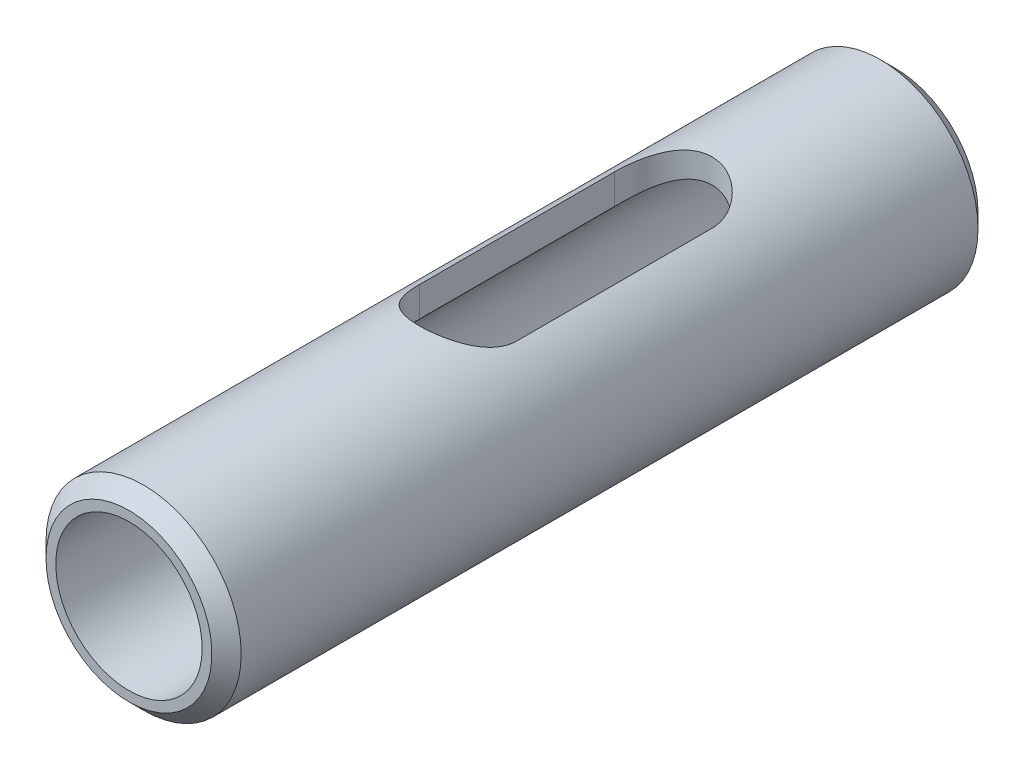
ISO-10303-21;
HEADER;
FILE_DESCRIPTION(('STEP AP214'),'2;1');
FILE_NAME('part.step','',(''),(''),'','','');
FILE_SCHEMA(('AUTOMOTIVE_DESIGN { 1 0 10303 214 1 1 1 1 }'));
ENDSEC;
DATA;
#1=APPLICATION_CONTEXT('core data for automotive mechanical design processes');
#2=APPLICATION_PROTOCOL_DEFINITION('international standard','automotive_design',2000,#1);
#3=PRODUCT_CONTEXT('',#1,'mechanical');
#4=PRODUCT('Part','Part','',(#3));
#5=PRODUCT_RELATED_PRODUCT_CATEGORY('part','',(#4));
#6=PRODUCT_DEFINITION_FORMATION('','',#4);
#7=PRODUCT_DEFINITION_CONTEXT('part definition',#1,'design');
#8=PRODUCT_DEFINITION('design','',#6,#7);
#9=PRODUCT_DEFINITION_SHAPE('','',#8);
#10=(LENGTH_UNIT() NAMED_UNIT(*) SI_UNIT(.MILLI.,.METRE.));
#11=(NAMED_UNIT(*) PLANE_ANGLE_UNIT() SI_UNIT($,.RADIAN.));
#12=(NAMED_UNIT(*) SI_UNIT($,.STERADIAN.) SOLID_ANGLE_UNIT());
#13=UNCERTAINTY_MEASURE_WITH_UNIT(LENGTH_MEASURE(1.E-05),#10,'distance_accuracy_value','');
#14=(GEOMETRIC_REPRESENTATION_CONTEXT(3) GLOBAL_UNCERTAINTY_ASSIGNED_CONTEXT((#13)) GLOBAL_UNIT_ASSIGNED_CONTEXT((#10,
#11,#12)) REPRESENTATION_CONTEXT('',''));
#15=CARTESIAN_POINT('',(0.,0.,0.));
#16=DIRECTION('',(0.,0.,1.));
#17=DIRECTION('',(1.,0.,0.));
#18=AXIS2_PLACEMENT_3D('',#15,#16,#17);
#19=CARTESIAN_POINT('',(0.,0.,0.));
#20=DIRECTION('',(0.,0.,1.));
#21=DIRECTION('',(1.,0.,0.));
#22=AXIS2_PLACEMENT_3D('',#19,#20,#21);
#23=CYLINDRICAL_SURFACE('',#22,15.);
#24=DIRECTION('',(0.,0.,1.));
#25=VECTOR('',#24,1.);
#26=CARTESIAN_POINT('',(-9.99999999999997,11.180339887499,0.));
#27=LINE('',#26,#25);
#28=CARTESIAN_POINT('',(-9.99999999999997,11.180339887499,-376.5));
#29=VERTEX_POINT('',#28);
#30=CARTESIAN_POINT('',(-10.,11.1803398874989,-416.5));
#31=VERTEX_POINT('',#30);
#32=EDGE_CURVE('E91',#29,#31,#27,.F.);
#33=ORIENTED_EDGE('',*,*,#32,.F.);
#34=CARTESIAN_POINT('',(10.,11.1803398874989,-376.5));
#35=CARTESIAN_POINT('',(10.0000019662644,11.1803341285553,-376.377091916708));
#36=CARTESIAN_POINT('',(9.99773339672962,11.182367652214,-376.254204561337));
#37=CARTESIAN_POINT('',(9.98868075195432,11.1904562528802,-376.008740842228));
#38=CARTESIAN_POINT('',(9.98189712810507,11.196510927874,-375.88616444863));
#39=CARTESIAN_POINT('',(9.95484008556213,11.2205962021832,-375.5196585295));
#40=CARTESIAN_POINT('',(9.92786031801124,11.2445484143372,-375.276559245633));
#41=CARTESIAN_POINT('',(9.85692199140147,11.3067794801167,-374.797283930893));
#42=CARTESIAN_POINT('',(9.81313360307207,11.3449146287484,-374.56106325413));
#43=CARTESIAN_POINT('',(9.70933595979469,11.4338733583765,-374.094609159852));
#44=CARTESIAN_POINT('',(9.64932198669644,11.4847006297179,-373.864377505231));
#45=CARTESIAN_POINT('',(9.51430209888207,11.5967965567622,-373.412379236925));
#46=CARTESIAN_POINT('',(9.43937638209315,11.6580091094161,-373.190574591012));
#47=CARTESIAN_POINT('',(9.2752123820489,11.7890411827064,-372.755053191234));
#48=CARTESIAN_POINT('',(9.18597482688439,11.8588602654582,-372.541336026614));
#49=CARTESIAN_POINT('',(8.89735329466268,12.0787194524851,-371.911924424127));
#50=CARTESIAN_POINT('',(8.6773562973776,12.2389043780612,-371.50894455495));
#51=CARTESIAN_POINT('',(8.29129524792108,12.5013515100962,-370.903245147719));
#52=CARTESIAN_POINT('',(8.14170204702141,12.5994998696131,-370.687835891369));
#53=CARTESIAN_POINT('',(7.82649231833529,12.7976804602116,-370.26987326745));
#54=CARTESIAN_POINT('',(7.66087472678606,12.8977128160049,-370.067320754843));
#55=CARTESIAN_POINT('',(7.31418209262195,13.0974342938179,-369.67569341647));
#56=CARTESIAN_POINT('',(7.13310489225781,13.1971233658976,-369.486620478874));
#57=CARTESIAN_POINT('',(6.75590366095744,13.3941428962359,-369.122568514872));
#58=CARTESIAN_POINT('',(6.55977230733853,13.4914721759597,-368.947596433361));
#59=CARTESIAN_POINT('',(6.12350040303772,13.6955771283599,-368.588379093624));
#60=CARTESIAN_POINT('',(5.88110397785955,13.8016735607452,-368.406473795747));
#61=CARTESIAN_POINT('',(5.37841190890665,14.0052195059546,-368.06405851657));
#62=CARTESIAN_POINT('',(5.11812584836928,14.1026735852692,-367.903537213495));
#63=CARTESIAN_POINT('',(4.58092530474233,14.2862046380633,-367.605653577699));
#64=CARTESIAN_POINT('',(4.30401783641958,14.3722863626223,-367.468281567143));
#65=CARTESIAN_POINT('',(3.73529722016774,14.5304715239106,-367.218624389387));
#66=CARTESIAN_POINT('',(3.4434872833432,14.6025779560387,-367.106333845555));
#67=CARTESIAN_POINT('',(2.88082821284891,14.723250182534,-366.919887664078));
#68=CARTESIAN_POINT('',(2.61129919972896,14.7735492311711,-366.842867370373));
#69=CARTESIAN_POINT('',(2.06452942296248,14.8598209230397,-366.711397192377));
#70=CARTESIAN_POINT('',(1.78728918107015,14.8957945330429,-366.656945784983));
#71=CARTESIAN_POINT('',(1.22793917300901,14.9522941504247,-366.571650672108));
#72=CARTESIAN_POINT('',(0.945834860668389,14.9728364372598,-366.540782087064));
#73=CARTESIAN_POINT('',(0.379327505846199,14.9978816841611,-366.503167584483));
#74=CARTESIAN_POINT('',(0.0949247933797864,15.00238690729,-366.496418263367));
#75=CARTESIAN_POINT('',(-0.429890333129024,14.9957738621773,-366.506340537065));
#76=CARTESIAN_POINT('',(-0.670405430373823,14.9869306305415,-366.519601560667));
#77=CARTESIAN_POINT('',(-1.14916934748079,14.9578376542313,-366.563341738393));
#78=CARTESIAN_POINT('',(-1.38741821686985,14.9375881594182,-366.593820515351));
#79=CARTESIAN_POINT('',(-1.85994161349591,14.8861382030705,-366.671573987246));
#80=CARTESIAN_POINT('',(-2.09421618238099,14.8549378563681,-366.718848506059));
#81=CARTESIAN_POINT('',(-2.55727839003124,14.7822617118014,-366.829580908424));
#82=CARTESIAN_POINT('',(-2.78606579121633,14.7407854698953,-366.893039491325));
#83=CARTESIAN_POINT('',(-3.2358600411086,14.6486073470994,-367.035085660705));
#84=CARTESIAN_POINT('',(-3.45689579211393,14.5979453708846,-367.113607890142));
#85=CARTESIAN_POINT('',(-3.89118343175868,14.4882323039131,-367.285162802909));
#86=CARTESIAN_POINT('',(-4.1044327303078,14.4291784530634,-367.378200261296));
#87=CARTESIAN_POINT('',(-4.52213359273532,14.3037704642793,-367.577899010554));
#88=CARTESIAN_POINT('',(-4.72658750024244,14.2374182880364,-367.684556641742));
#89=CARTESIAN_POINT('',(-5.1261302684335,14.0984944832681,-367.910732714781));
#90=CARTESIAN_POINT('',(-5.32121574797325,14.0259206352203,-368.030255750162));
#91=CARTESIAN_POINT('',(-5.72633078565189,13.8658779971489,-368.297833536126));
#92=CARTESIAN_POINT('',(-5.9349687223394,13.7777035729189,-368.447574696087));
#93=CARTESIAN_POINT('',(-6.33894603460613,13.5965729756602,-368.761572997494));
#94=CARTESIAN_POINT('',(-6.53427941602821,13.5036146800134,-368.925836606211));
#95=CARTESIAN_POINT('',(-6.91132960510198,13.3145806026908,-369.268232211218));
#96=CARTESIAN_POINT('',(-7.09302687376191,13.2185006199907,-369.446383389261));
#97=CARTESIAN_POINT('',(-7.44198959608793,13.0252280827419,-369.815592872798));
#98=CARTESIAN_POINT('',(-7.60925973806328,12.9280359013365,-370.006646949046));
#99=CARTESIAN_POINT('',(-7.95384735185594,12.7193915728318,-370.431854034939));
#100=CARTESIAN_POINT('',(-8.1286844791081,12.6080713984021,-370.668089943299));
#101=CARTESIAN_POINT('',(-8.45775206098621,12.3897309634299,-371.15648510251));
#102=CARTESIAN_POINT('',(-8.61197769657104,12.2827117125346,-371.408648056938));
#103=CARTESIAN_POINT('',(-8.89853128768457,12.0767233207896,-371.927911810312));
#104=CARTESIAN_POINT('',(-9.03088152717083,11.977746040699,-372.194997032415));
#105=CARTESIAN_POINT('',(-9.27240645990513,11.7917648681875,-372.743387189988));
#106=CARTESIAN_POINT('',(-9.38159284001155,11.7047549457079,-373.024684865725));
#107=CARTESIAN_POINT('',(-9.54801158638539,11.5690778214802,-373.519520672701));
#108=CARTESIAN_POINT('',(-9.6112317703753,11.5164952118853,-373.729986596126));
#109=CARTESIAN_POINT('',(-9.72408164930217,11.4213698799914,-374.156731191666));
#110=CARTESIAN_POINT('',(-9.77371524585158,11.378824275887,-374.373008175406));
#111=CARTESIAN_POINT('',(-9.85861049231011,11.3053505181962,-374.80969088716));
#112=CARTESIAN_POINT('',(-9.89391085780341,11.2743910871009,-375.030083788234));
#113=CARTESIAN_POINT('',(-9.94974461286419,11.2251497436318,-375.47405210704));
#114=CARTESIAN_POINT('',(-9.97028723032152,11.206859909327,-375.697625446715));
#115=CARTESIAN_POINT('',(-9.98884716882533,11.1903071254827,-376.0180954268));
#116=CARTESIAN_POINT('',(-9.99302852832224,11.1865722173173,-376.114407031482));
#117=CARTESIAN_POINT('',(-9.99860456831422,11.1815883268953,-376.307141472712));
#118=CARTESIAN_POINT('',(-10.0000002177439,11.1803384802772,-376.403564258909));
#119=CARTESIAN_POINT('',(-10.,11.1803398874989,-376.5));
#120=B_SPLINE_CURVE_WITH_KNOTS('',3,(#34,#35,#36,#37,#38,#39,#40,#41,#42,#43,#44,#45,#46,#47,
#48,#49,#50,#51,#52,#53,#54,#55,#56,#57,#58,#59,#60,#61,#62,#63,#64,#65,#66,#67,#68,#69,#70,#71,
#72,#73,#74,#75,#76,#77,#78,#79,#80,#81,#82,#83,#84,#85,#86,#87,#88,#89,#90,#91,#92,#93,#94,#95,
#96,#97,#98,#99,#100,#101,#102,#103,#104,#105,#106,#107,#108,#109,#110,#111,#112,#113,#114,#115,
#116,#117,#118,#119),.UNSPECIFIED.,.F.,.F.,(4,2,2,2,2,2,2,2,2,2,2,2,2,2,2,2,2,2,2,2,2,2,2,2,2,2,
2,2,2,2,2,2,2,2,2,2,2,2,2,2,2,2,4),(0.,0.368646050186391,0.73725525062168,1.47329974643745,
2.20208108990009,2.93107458010894,3.65624850314495,4.3813855458673,5.83478174144708,
6.67426475194121,7.51380352894203,8.35345967533998,9.19352686995972,10.1555208892916,
11.1170035384646,12.078083225863,13.0389566915796,13.8920552544147,14.745096234968,
15.5972360211362,16.4492555532334,17.1715077978443,17.8937442216846,18.6159730722762,
19.3382331372499,20.0574276279282,20.7768592119827,21.4960978929086,22.2155942317108,
23.0293731080495,23.8435162270739,24.658804488051,25.4738268028542,26.4155476148542,
27.3574882208219,28.2984632997486,29.2389624936458,29.9162147428956,30.5932723034907,
31.2684886948953,31.9432825110778,32.2326465857275,32.5219099952884),.UNSPECIFIED.);
#121=CARTESIAN_POINT('',(10.,11.1803398874989,-376.5));
#122=VERTEX_POINT('',#121);
#123=EDGE_CURVE('E54',#122,#29,#120,.T.);
#124=ORIENTED_EDGE('',*,*,#123,.F.);
#125=DIRECTION('',(0.,0.,1.));
#126=VECTOR('',#125,1.);
#127=CARTESIAN_POINT('',(9.99999999999998,11.180339887499,0.));
#128=LINE('',#127,#126);
#129=CARTESIAN_POINT('',(10.,11.180339887499,-416.5));
#130=VERTEX_POINT('',#129);
#131=EDGE_CURVE('E97',#130,#122,#128,.T.);
#132=ORIENTED_EDGE('',*,*,#131,.F.);
#133=CARTESIAN_POINT('',(-10.,11.1803398874989,-416.5));
#134=CARTESIAN_POINT('',(-10.0000019662644,11.1803341285553,-416.622908083292));
#135=CARTESIAN_POINT('',(-9.99773339672963,11.182367652214,-416.745795438663));
#136=CARTESIAN_POINT('',(-9.98868075195433,11.1904562528802,-416.991259157772));
#137=CARTESIAN_POINT('',(-9.98189712810507,11.196510927874,-417.11383555137));
#138=CARTESIAN_POINT('',(-9.95484008556213,11.2205962021832,-417.4803414705));
#139=CARTESIAN_POINT('',(-9.92786031801125,11.2445484143372,-417.723440754367));
#140=CARTESIAN_POINT('',(-9.85692199140149,11.3067794801167,-418.202716069107));
#141=CARTESIAN_POINT('',(-9.81313360307207,11.3449146287484,-418.43893674587));
#142=CARTESIAN_POINT('',(-9.70933595979469,11.4338733583765,-418.905390840148));
#143=CARTESIAN_POINT('',(-9.64932198669644,11.4847006297179,-419.135622494769));
#144=CARTESIAN_POINT('',(-9.51430209888208,11.5967965567622,-419.587620763075));
#145=CARTESIAN_POINT('',(-9.43937638209316,11.6580091094161,-419.809425408988));
#146=CARTESIAN_POINT('',(-9.27521238204891,11.7890411827064,-420.244946808766));
#147=CARTESIAN_POINT('',(-9.1859748268844,11.8588602654581,-420.458663973386));
#148=CARTESIAN_POINT('',(-8.89735329466269,12.0787194524851,-421.088075575873));
#149=CARTESIAN_POINT('',(-8.6773562973776,12.2389043780612,-421.49105544505));
#150=CARTESIAN_POINT('',(-8.29129524792109,12.5013515100962,-422.096754852281));
#151=CARTESIAN_POINT('',(-8.14170204702142,12.5994998696131,-422.312164108631));
#152=CARTESIAN_POINT('',(-7.8264923183353,12.7976804602116,-422.73012673255));
#153=CARTESIAN_POINT('',(-7.66087472678607,12.8977128160049,-422.932679245157));
#154=CARTESIAN_POINT('',(-7.31418209262197,13.0974342938179,-423.32430658353));
#155=CARTESIAN_POINT('',(-7.13310489225784,13.1971233658976,-423.513379521127));
#156=CARTESIAN_POINT('',(-6.75590366095747,13.3941428962359,-423.877431485128));
#157=CARTESIAN_POINT('',(-6.55977230733855,13.4914721759597,-424.052403566639));
#158=CARTESIAN_POINT('',(-6.12350040303773,13.6955771283599,-424.411620906376));
#159=CARTESIAN_POINT('',(-5.88110397785956,13.8016735607452,-424.593526204253));
#160=CARTESIAN_POINT('',(-5.37841190890666,14.0052195059546,-424.93594148343));
#161=CARTESIAN_POINT('',(-5.11812584836929,14.1026735852692,-425.096462786505));
#162=CARTESIAN_POINT('',(-4.58092530474234,14.2862046380633,-425.394346422301));
#163=CARTESIAN_POINT('',(-4.30401783641959,14.3722863626223,-425.531718432857));
#164=CARTESIAN_POINT('',(-3.73529722016775,14.5304715239106,-425.781375610613));
#165=CARTESIAN_POINT('',(-3.44348728334321,14.6025779560387,-425.893666154445));
#166=CARTESIAN_POINT('',(-2.88082821284893,14.723250182534,-426.080112335922));
#167=CARTESIAN_POINT('',(-2.61129919972899,14.7735492311711,-426.157132629627));
#168=CARTESIAN_POINT('',(-2.06452942296251,14.8598209230397,-426.288602807623));
#169=CARTESIAN_POINT('',(-1.78728918107017,14.8957945330429,-426.343054215018));
#170=CARTESIAN_POINT('',(-1.22793917300902,14.9522941504247,-426.428349327892));
#171=CARTESIAN_POINT('',(-0.945834860668402,14.9728364372598,-426.459217912936));
#172=CARTESIAN_POINT('',(-0.379327505846211,14.9978816841611,-426.496832415517));
#173=CARTESIAN_POINT('',(-0.0949247933797957,15.00238690729,-426.503581736633));
#174=CARTESIAN_POINT('',(0.429890333129018,14.9957738621773,-426.493659462935));
#175=CARTESIAN_POINT('',(0.670405430373816,14.9869306305415,-426.480398439333));
#176=CARTESIAN_POINT('',(1.14916934748079,14.9578376542313,-426.436658261607));
#177=CARTESIAN_POINT('',(1.38741821686984,14.9375881594182,-426.406179484649));
#178=CARTESIAN_POINT('',(1.8599416134959,14.8861382030705,-426.328426012754));
#179=CARTESIAN_POINT('',(2.09421618238097,14.8549378563681,-426.281151493941));
#180=CARTESIAN_POINT('',(2.55727839003122,14.7822617118014,-426.170419091576));
#181=CARTESIAN_POINT('',(2.78606579121632,14.7407854698953,-426.106960508675));
#182=CARTESIAN_POINT('',(3.2358600411086,14.6486073470994,-425.964914339295));
#183=CARTESIAN_POINT('',(3.45689579211394,14.5979453708846,-425.886392109858));
#184=CARTESIAN_POINT('',(3.8911834317587,14.4882323039131,-425.714837197091));
#185=CARTESIAN_POINT('',(4.10443273030781,14.4291784530634,-425.621799738704));
#186=CARTESIAN_POINT('',(4.52213359273533,14.3037704642793,-425.422100989445));
#187=CARTESIAN_POINT('',(4.72658750024246,14.2374182880364,-425.315443358258));
#188=CARTESIAN_POINT('',(5.12613026843353,14.0984944832681,-425.089267285219));
#189=CARTESIAN_POINT('',(5.32121574797326,14.0259206352203,-424.969744249838));
#190=CARTESIAN_POINT('',(5.72633078565187,13.8658779971489,-424.702166463874));
#191=CARTESIAN_POINT('',(5.93496872233936,13.7777035729189,-424.552425303913));
#192=CARTESIAN_POINT('',(6.33894603460609,13.5965729756602,-424.238427002506));
#193=CARTESIAN_POINT('',(6.53427941602819,13.5036146800134,-424.074163393789));
#194=CARTESIAN_POINT('',(6.91132960510198,13.3145806026908,-423.731767788782));
#195=CARTESIAN_POINT('',(7.09302687376191,13.2185006199907,-423.55361661074));
#196=CARTESIAN_POINT('',(7.44198959608793,13.0252280827419,-423.184407127202));
#197=CARTESIAN_POINT('',(7.60925973806327,12.9280359013365,-422.993353050954));
#198=CARTESIAN_POINT('',(7.95384735185595,12.7193915728318,-422.568145965061));
#199=CARTESIAN_POINT('',(8.12868447910813,12.6080713984021,-422.331910056701));
#200=CARTESIAN_POINT('',(8.45775206098623,12.3897309634299,-421.84351489749));
#201=CARTESIAN_POINT('',(8.61197769657105,12.2827117125346,-421.591351943062));
#202=CARTESIAN_POINT('',(8.89853128768456,12.0767233207896,-421.072088189688));
#203=CARTESIAN_POINT('',(9.03088152717083,11.977746040699,-420.805002967585));
#204=CARTESIAN_POINT('',(9.27240645990513,11.7917648681875,-420.256612810012));
#205=CARTESIAN_POINT('',(9.38159284001155,11.7047549457079,-419.975315134275));
#206=CARTESIAN_POINT('',(9.54801158638537,11.5690778214802,-419.480479327299));
#207=CARTESIAN_POINT('',(9.61123177037527,11.5164952118853,-419.270013403874));
#208=CARTESIAN_POINT('',(9.72408164930215,11.4213698799914,-418.843268808334));
#209=CARTESIAN_POINT('',(9.77371524585157,11.378824275887,-418.626991824594));
#210=CARTESIAN_POINT('',(9.8586104923101,11.3053505181962,-418.19030911284));
#211=CARTESIAN_POINT('',(9.89391085780339,11.2743910871009,-417.969916211766));
#212=CARTESIAN_POINT('',(9.94974461286418,11.2251497436318,-417.52594789296));
#213=CARTESIAN_POINT('',(9.97028723032152,11.206859909327,-417.302374553285));
#214=CARTESIAN_POINT('',(9.98884716882533,11.1903071254827,-416.9819045732));
#215=CARTESIAN_POINT('',(9.99302852832223,11.1865722173173,-416.885592968518));
#216=CARTESIAN_POINT('',(9.99860456831422,11.1815883268953,-416.692858527288));
#217=CARTESIAN_POINT('',(10.0000002177439,11.1803384802772,-416.596435741091));
#218=CARTESIAN_POINT('',(10.,11.1803398874989,-416.5));
#219=B_SPLINE_CURVE_WITH_KNOTS('',3,(#133,#134,#135,#136,#137,#138,#139,#140,#141,#142,#143,
#144,#145,#146,#147,#148,#149,#150,#151,#152,#153,#154,#155,#156,#157,#158,#159,#160,#161,#162,
#163,#164,#165,#166,#167,#168,#169,#170,#171,#172,#173,#174,#175,#176,#177,#178,#179,#180,#181,
#182,#183,#184,#185,#186,#187,#188,#189,#190,#191,#192,#193,#194,#195,#196,#197,#198,#199,#200,
#201,#202,#203,#204,#205,#206,#207,#208,#209,#210,#211,#212,#213,#214,#215,#216,#217,#218),
.UNSPECIFIED.,.F.,.F.,(4,2,2,2,2,2,2,2,2,2,2,2,2,2,2,2,2,2,2,2,2,2,2,2,2,2,2,2,2,2,2,2,2,2,2,2,
2,2,2,2,2,2,4),(0.,0.368646050186446,0.737255250621735,1.47329974643751,2.20208108990009,
2.93107458010895,3.65624850314496,4.3813855458673,5.83478174144708,6.67426475194121,
7.51380352894203,8.35345967533996,9.19352686995972,10.1555208892916,11.1170035384646,
12.078083225863,13.0389566915796,13.8920552544147,14.745096234968,15.5972360211362,
16.4492555532334,17.1715077978443,17.8937442216846,18.6159730722762,19.33823313725,
20.0574276279282,20.7768592119827,21.4960978929086,22.2155942317108,23.0293731080495,
23.8435162270739,24.658804488051,25.4738268028542,26.4155476148543,27.357488220822,
28.2984632997486,29.2389624936458,29.9162147428955,30.5932723034907,31.2684886948952,
31.9432825110778,32.2326465857275,32.5219099952885),.UNSPECIFIED.);
#220=EDGE_CURVE('E82',#31,#130,#219,.T.);
#221=ORIENTED_EDGE('',*,*,#220,.F.);
#222=EDGE_LOOP('',(#33,#124,#132,#221));
#223=FACE_BOUND('',#222,.T.);
#224=CARTESIAN_POINT('',(0.,0.,-464.));
#225=DIRECTION('',(0.,0.,1.));
#226=DIRECTION('',(1.,0.,0.));
#227=AXIS2_PLACEMENT_3D('',#224,#225,#226);
#228=CIRCLE('',#227,15.);
#229=CARTESIAN_POINT('',(15.,0.,-464.));
#230=VERTEX_POINT('',#229);
#231=EDGE_CURVE('E141',#230,#230,#228,.T.);
#232=ORIENTED_EDGE('',*,*,#231,.F.);
#233=EDGE_LOOP('',(#232));
#234=FACE_BOUND('',#233,.T.);
#235=CARTESIAN_POINT('',(0.,0.,-307.));
#236=DIRECTION('',(0.,0.,1.));
#237=DIRECTION('',(1.,0.,0.));
#238=AXIS2_PLACEMENT_3D('',#235,#236,#237);
#239=CIRCLE('',#238,15.);
#240=CARTESIAN_POINT('',(15.,0.,-307.));
#241=VERTEX_POINT('',#240);
#242=EDGE_CURVE('E99',#241,#241,#239,.T.);
#243=ORIENTED_EDGE('',*,*,#242,.T.);
#244=EDGE_LOOP('',(#243));
#245=FACE_BOUND('',#244,.T.);
#246=ADVANCED_FACE('F39',(#223,#234,#245),#23,.F.);
#247=CARTESIAN_POINT('',(0.,0.,-464.));
#248=DIRECTION('',(0.,0.,1.));
#249=DIRECTION('',(1.,0.,0.));
#250=AXIS2_PLACEMENT_3D('',#247,#248,#249);
#251=PLANE('',#250);
#252=CARTESIAN_POINT('',(0.,0.,-464.));
#253=DIRECTION('',(0.,0.,1.));
#254=DIRECTION('',(1.,0.,0.));
#255=AXIS2_PLACEMENT_3D('',#252,#253,#254);
#256=CIRCLE('',#255,16.9999999999999);
#257=CARTESIAN_POINT('',(16.9999999999999,0.,-464.));
#258=VERTEX_POINT('',#257);
#259=EDGE_CURVE('E147',#258,#258,#256,.F.);
#260=ORIENTED_EDGE('',*,*,#259,.T.);
#261=EDGE_LOOP('',(#260));
#262=FACE_BOUND('',#261,.T.);
#263=ORIENTED_EDGE('',*,*,#231,.T.);
#264=EDGE_LOOP('',(#263));
#265=FACE_BOUND('',#264,.T.);
#266=ADVANCED_FACE('F163',(#262,#265),#251,.F.);
#267=CARTESIAN_POINT('',(0.,0.,0.));
#268=DIRECTION('',(0.,0.,1.));
#269=DIRECTION('',(1.,0.,0.));
#270=AXIS2_PLACEMENT_3D('',#267,#268,#269);
#271=CYLINDRICAL_SURFACE('',#270,19.9999999999999);
#272=CARTESIAN_POINT('',(0.,0.,-310.));
#273=DIRECTION('',(0.,0.,-1.));
#274=DIRECTION('',(-1.,0.,0.));
#275=AXIS2_PLACEMENT_3D('',#272,#273,#274);
#276=CIRCLE('',#275,19.9999999999999);
#277=CARTESIAN_POINT('',(-19.9999999999999,0.,-310.));
#278=VERTEX_POINT('',#277);
#279=EDGE_CURVE('E11',#278,#278,#276,.T.);
#280=ORIENTED_EDGE('',*,*,#279,.T.);
#281=EDGE_LOOP('',(#280));
#282=FACE_BOUND('',#281,.T.);
#283=CARTESIAN_POINT('',(0.,0.,-461.));
#284=DIRECTION('',(0.,0.,1.));
#285=DIRECTION('',(1.,0.,0.));
#286=AXIS2_PLACEMENT_3D('',#283,#284,#285);
#287=CIRCLE('',#286,19.9999999999999);
#288=CARTESIAN_POINT('',(19.9999999999999,0.,-461.));
#289=VERTEX_POINT('',#288);
#290=EDGE_CURVE('E144',#289,#289,#287,.T.);
#291=ORIENTED_EDGE('',*,*,#290,.T.);
#292=EDGE_LOOP('',(#291));
#293=FACE_BOUND('',#292,.T.);
#294=DIRECTION('',(0.,0.,1.));
#295=VECTOR('',#294,1.);
#296=CARTESIAN_POINT('',(9.99999999999998,17.3205080756887,0.));
#297=LINE('',#296,#295);
#298=CARTESIAN_POINT('',(10.,17.3205080756886,-376.5));
#299=VERTEX_POINT('',#298);
#300=CARTESIAN_POINT('',(10.,17.3205080756887,-416.5));
#301=VERTEX_POINT('',#300);
#302=EDGE_CURVE('E182',#299,#301,#297,.F.);
#303=ORIENTED_EDGE('',*,*,#302,.F.);
#304=CARTESIAN_POINT('',(-10.,17.3205080756886,-376.5));
#305=CARTESIAN_POINT('',(-10.0000009842124,17.3205050641393,-376.369051811282));
#306=CARTESIAN_POINT('',(-9.99742732625388,17.3219937060934,-376.23812209713));
#307=CARTESIAN_POINT('',(-9.98714776425291,17.3279234432274,-375.976538198109));
#308=CARTESIAN_POINT('',(-9.97944213678539,17.3323643793007,-375.845883998772));
#309=CARTESIAN_POINT('',(-9.94866974837697,17.3500596416634,-375.454891273438));
#310=CARTESIAN_POINT('',(-9.91794741881243,17.3676865249699,-375.195300981241));
#311=CARTESIAN_POINT('',(-9.8367362974047,17.4138095844314,-374.68180403485));
#312=CARTESIAN_POINT('',(-9.78636180553136,17.4422428845971,-374.427873332549));
#313=CARTESIAN_POINT('',(-9.66646257715093,17.5089748862128,-373.925878337959));
#314=CARTESIAN_POINT('',(-9.59693564097867,17.5472747208051,-373.677814723062));
#315=CARTESIAN_POINT('',(-9.43968016486583,17.6323679545355,-373.189709508798));
#316=CARTESIAN_POINT('',(-9.35199562450873,17.6791407881832,-372.949650116678));
#317=CARTESIAN_POINT('',(-9.15913679566112,17.7798210765098,-372.478165484807));
#318=CARTESIAN_POINT('',(-9.05395571516242,17.8337313001977,-372.246743640962));
#319=CARTESIAN_POINT('',(-8.71317979765281,18.004029510897,-371.566681423948));
#320=CARTESIAN_POINT('',(-8.45244203102759,18.1289341451499,-371.132519977552));
#321=CARTESIAN_POINT('',(-7.84654710730718,18.3997336003356,-370.276765603735));
#322=CARTESIAN_POINT('',(-7.4962295883788,18.5465096451786,-369.859104888229));
#323=CARTESIAN_POINT('',(-6.92338914550206,18.764559002018,-369.27914764027));
#324=CARTESIAN_POINT('',(-6.72441003875205,18.8369339416623,-369.093483414635));
#325=CARTESIAN_POINT('',(-6.31150716738824,18.9792644744861,-368.738627390106));
#326=CARTESIAN_POINT('',(-6.09758884564934,19.0492209350567,-368.569429645124));
#327=CARTESIAN_POINT('',(-5.6407717306487,19.1896485279328,-368.237632513399));
#328=CARTESIAN_POINT('',(-5.39689141389575,19.2598321641551,-368.076260944162));
#329=CARTESIAN_POINT('',(-4.89455061133217,19.3935793416828,-367.774796784082));
#330=CARTESIAN_POINT('',(-4.63608928609078,19.4571425012457,-367.63470542006));
#331=CARTESIAN_POINT('',(-4.10635677049248,19.5757876618576,-367.377253080332));
#332=CARTESIAN_POINT('',(-3.83509177129904,19.6308737081772,-367.259881255945));
#333=CARTESIAN_POINT('',(-3.28159507983375,19.730944952434,-367.049137810231));
#334=CARTESIAN_POINT('',(-2.99936455702266,19.7759312240511,-366.955763637626));
#335=CARTESIAN_POINT('',(-2.44661833360226,19.8516058112223,-366.799971819808));
#336=CARTESIAN_POINT('',(-2.17669780598389,19.883083674864,-366.735824344701));
#337=CARTESIAN_POINT('',(-1.63144213832667,19.9352295762844,-366.630070884111));
#338=CARTESIAN_POINT('',(-1.35610723409281,19.9558980837512,-366.588463919194));
#339=CARTESIAN_POINT('',(-0.802445521603447,19.9858175787376,-366.528361031844));
#340=CARTESIAN_POINT('',(-0.524120257703823,19.9950741985479,-366.509853708621));
#341=CARTESIAN_POINT('',(0.0332395851752051,20.0019136401319,-366.496171294722));
#342=CARTESIAN_POINT('',(0.312274119721431,19.9994971760034,-366.50099477679));
#343=CARTESIAN_POINT('',(0.844367806078204,19.9837838331363,-366.532464100389));
#344=CARTESIAN_POINT('',(1.0975729406055,19.9714527723846,-366.557173019377));
#345=CARTESIAN_POINT('',(1.60073183471952,19.937432846493,-366.625684115406));
#346=CARTESIAN_POINT('',(1.85068582195496,19.9157446402237,-366.669484948119));
#347=CARTESIAN_POINT('',(2.34565858124273,19.8635300347526,-366.775702507222));
#348=CARTESIAN_POINT('',(2.59067728660308,19.8330035162015,-366.838119484998));
#349=CARTESIAN_POINT('',(3.0742352862169,19.7638242045078,-366.98093253157));
#350=CARTESIAN_POINT('',(3.31277434779747,19.7251711199886,-367.061329245032));
#351=CARTESIAN_POINT('',(3.78518954169202,19.6400282142617,-367.240571388394));
#352=CARTESIAN_POINT('',(4.01895833848331,19.5934390847712,-367.33965255813));
#353=CARTESIAN_POINT('',(4.47722056603934,19.4938343438957,-367.554686888776));
#354=CARTESIAN_POINT('',(4.70171067275901,19.4408164557422,-367.670646030012));
#355=CARTESIAN_POINT('',(5.35951315865149,19.2738119392068,-368.042510567488));
#356=CARTESIAN_POINT('',(5.77743531530483,19.1518223778732,-368.322509352857));
#357=CARTESIAN_POINT('',(6.60182721893081,18.8844158487148,-368.969018111231));
#358=CARTESIAN_POINT('',(7.00348722464228,18.7378744077244,-369.341201200031));
#359=CARTESIAN_POINT('',(7.55652262572434,18.5186003057333,-369.944570924804));
#360=CARTESIAN_POINT('',(7.7327471881284,18.445540032032,-370.153396286568));
#361=CARTESIAN_POINT('',(8.06789407393764,18.3014290360876,-370.585293192426));
#362=CARTESIAN_POINT('',(8.22681373564497,18.2303786242255,-370.80836691974));
#363=CARTESIAN_POINT('',(8.53597765279313,18.0877840708844,-371.282502042699));
#364=CARTESIAN_POINT('',(8.68500029231326,18.0165039408336,-371.534440575752));
#365=CARTESIAN_POINT('',(8.96097966642787,17.8808412437644,-372.051772124012));
#366=CARTESIAN_POINT('',(9.08794650998954,17.8164555220079,-372.317158902972));
#367=CARTESIAN_POINT('',(9.31839935335131,17.6970127957931,-372.85938711412));
#368=CARTESIAN_POINT('',(9.42192743721451,17.6419391174122,-373.136206944118));
#369=CARTESIAN_POINT('',(9.60448489001812,17.5432230102062,-373.699733190566));
#370=CARTESIAN_POINT('',(9.68352487417582,17.4995756295312,-373.986435263152));
#371=CARTESIAN_POINT('',(9.79104748365429,17.4395411717119,-374.457958077846));
#372=CARTESIAN_POINT('',(9.82736239764818,17.4190767417807,-374.640516076512));
#373=CARTESIAN_POINT('',(9.88980406716622,17.3837011157656,-375.007865417775));
#374=CARTESIAN_POINT('',(9.91593364474518,17.3687883815229,-375.192656127105));
#375=CARTESIAN_POINT('',(9.95786509659559,17.3447842335655,-375.564104331508));
#376=CARTESIAN_POINT('',(9.97364911968101,17.3357028824093,-375.750764491978));
#377=CARTESIAN_POINT('',(9.99472523916496,17.3235531022259,-376.124946609466));
#378=CARTESIAN_POINT('',(10.0000130458752,17.3204871316247,-376.312468887454));
#379=CARTESIAN_POINT('',(10.,17.3205080756886,-376.5));
#380=B_SPLINE_CURVE_WITH_KNOTS('',3,(#304,#305,#306,#307,#308,#309,#310,#311,#312,#313,#314,
#315,#316,#317,#318,#319,#320,#321,#322,#323,#324,#325,#326,#327,#328,#329,#330,#331,#332,#333,
#334,#335,#336,#337,#338,#339,#340,#341,#342,#343,#344,#345,#346,#347,#348,#349,#350,#351,#352,
#353,#354,#355,#356,#357,#358,#359,#360,#361,#362,#363,#364,#365,#366,#367,#368,#369,#370,#371,
#372,#373,#374,#375,#376,#377,#378,#379),.UNSPECIFIED.,.F.,.F.,(4,2,2,2,2,2,2,2,2,2,2,2,2,2,2,2,
2,2,2,2,2,2,2,2,2,2,2,2,2,2,2,2,2,2,2,2,2,4),(0.,0.39277432756564,0.785527489233178,
1.57037135503793,2.3507169170956,3.13115213951757,3.90971788549754,4.68858657241549,
6.24719698095279,7.93328360925702,8.77737560337267,9.62116165389614,10.5222327315746,
11.4233557370877,12.3240473851169,13.2246432376562,14.061163573831,14.8976475585061,
15.7337185344345,16.5697383645888,17.3329555452442,18.096118993782,18.8592927482724,
19.6224938708954,20.3960608010281,21.1699024973104,22.7166903951132,24.4095700168372,
25.2573755876402,26.1053113772902,27.0079653719239,27.9102045497694,28.8108106867752,
29.7110258767719,30.2724648773691,30.833748209103,31.3959974995908,31.9584765279151),.UNSPECIFIED.);
#381=CARTESIAN_POINT('',(-10.,17.3205080756886,-376.5));
#382=VERTEX_POINT('',#381);
#383=EDGE_CURVE('E127',#382,#299,#380,.T.);
#384=ORIENTED_EDGE('',*,*,#383,.F.);
#385=DIRECTION('',(0.,0.,1.));
#386=VECTOR('',#385,1.);
#387=CARTESIAN_POINT('',(-9.99999999999997,17.3205080756887,0.));
#388=LINE('',#387,#386);
#389=CARTESIAN_POINT('',(-9.99999999999997,17.3205080756887,-416.5));
#390=VERTEX_POINT('',#389);
#391=EDGE_CURVE('E138',#390,#382,#388,.T.);
#392=ORIENTED_EDGE('',*,*,#391,.F.);
#393=CARTESIAN_POINT('',(10.,17.3205080756886,-416.5));
#394=CARTESIAN_POINT('',(10.0000009842124,17.3205050641393,-416.630948188718));
#395=CARTESIAN_POINT('',(9.99742732625387,17.3219937060934,-416.76187790287));
#396=CARTESIAN_POINT('',(9.9871477642529,17.3279234432274,-417.023461801891));
#397=CARTESIAN_POINT('',(9.97944213678539,17.3323643793007,-417.154116001228));
#398=CARTESIAN_POINT('',(9.94866974837696,17.3500596416634,-417.545108726562));
#399=CARTESIAN_POINT('',(9.91794741881243,17.3676865249699,-417.804699018759));
#400=CARTESIAN_POINT('',(9.8367362974047,17.4138095844314,-418.31819596515));
#401=CARTESIAN_POINT('',(9.78636180553137,17.442242884597,-418.57212666745));
#402=CARTESIAN_POINT('',(9.66646257715095,17.5089748862127,-419.074121662041));
#403=CARTESIAN_POINT('',(9.59693564097867,17.5472747208051,-419.322185276938));
#404=CARTESIAN_POINT('',(9.43968016486582,17.6323679545355,-419.810290491202));
#405=CARTESIAN_POINT('',(9.35199562450873,17.6791407881832,-420.050349883322));
#406=CARTESIAN_POINT('',(9.15913679566112,17.7798210765098,-420.521834515193));
#407=CARTESIAN_POINT('',(9.05395571516242,17.8337313001977,-420.753256359038));
#408=CARTESIAN_POINT('',(8.7131797976528,18.004029510897,-421.433318576052));
#409=CARTESIAN_POINT('',(8.4524420310276,18.1289341451499,-421.867480022448));
#410=CARTESIAN_POINT('',(7.84654710730718,18.3997336003357,-422.723234396265));
#411=CARTESIAN_POINT('',(7.49622958837879,18.5465096451786,-423.140895111771));
#412=CARTESIAN_POINT('',(6.92338914550205,18.764559002018,-423.72085235973));
#413=CARTESIAN_POINT('',(6.72441003875204,18.8369339416623,-423.906516585365));
#414=CARTESIAN_POINT('',(6.31150716738822,18.9792644744861,-424.261372609894));
#415=CARTESIAN_POINT('',(6.09758884564933,19.0492209350567,-424.430570354876));
#416=CARTESIAN_POINT('',(5.6407717306487,19.1896485279328,-424.762367486602));
#417=CARTESIAN_POINT('',(5.39689141389575,19.2598321641551,-424.923739055838));
#418=CARTESIAN_POINT('',(4.89455061133217,19.3935793416828,-425.225203215918));
#419=CARTESIAN_POINT('',(4.63608928609078,19.4571425012457,-425.36529457994));
#420=CARTESIAN_POINT('',(4.10635677049249,19.5757876618576,-425.622746919668));
#421=CARTESIAN_POINT('',(3.83509177129906,19.6308737081772,-425.740118744056));
#422=CARTESIAN_POINT('',(3.28159507983377,19.7309449524339,-425.950862189769));
#423=CARTESIAN_POINT('',(2.99936455702267,19.7759312240511,-426.044236362374));
#424=CARTESIAN_POINT('',(2.44661833360226,19.8516058112223,-426.200028180193));
#425=CARTESIAN_POINT('',(2.17669780598389,19.883083674864,-426.264175655299));
#426=CARTESIAN_POINT('',(1.63144213832668,19.9352295762844,-426.369929115889));
#427=CARTESIAN_POINT('',(1.35610723409282,19.9558980837512,-426.411536080806));
#428=CARTESIAN_POINT('',(0.802445521603458,19.9858175787376,-426.471638968156));
#429=CARTESIAN_POINT('',(0.524120257703832,19.9950741985479,-426.490146291379));
#430=CARTESIAN_POINT('',(-0.0332395851752001,20.0019136401319,-426.503828705278));
#431=CARTESIAN_POINT('',(-0.312274119721429,19.9994971760034,-426.49900522321));
#432=CARTESIAN_POINT('',(-0.844367806078206,19.9837838331363,-426.467535899611));
#433=CARTESIAN_POINT('',(-1.09757294060551,19.9714527723846,-426.442826980623));
#434=CARTESIAN_POINT('',(-1.60073183471952,19.937432846493,-426.374315884594));
#435=CARTESIAN_POINT('',(-1.85068582195496,19.9157446402237,-426.330515051881));
#436=CARTESIAN_POINT('',(-2.34565858124273,19.8635300347526,-426.224297492778));
#437=CARTESIAN_POINT('',(-2.59067728660308,19.8330035162015,-426.161880515002));
#438=CARTESIAN_POINT('',(-3.0742352862169,19.7638242045078,-426.01906746843));
#439=CARTESIAN_POINT('',(-3.31277434779747,19.7251711199886,-425.938670754968));
#440=CARTESIAN_POINT('',(-3.78518954169202,19.6400282142617,-425.759428611606));
#441=CARTESIAN_POINT('',(-4.01895833848332,19.5934390847712,-425.66034744187));
#442=CARTESIAN_POINT('',(-4.47722056603934,19.4938343438957,-425.445313111224));
#443=CARTESIAN_POINT('',(-4.70171067275901,19.4408164557422,-425.329353969989));
#444=CARTESIAN_POINT('',(-5.3595131586515,19.2738119392068,-424.957489432512));
#445=CARTESIAN_POINT('',(-5.77743531530483,19.1518223778732,-424.677490647143));
#446=CARTESIAN_POINT('',(-6.6018272189308,18.8844158487148,-424.030981888769));
#447=CARTESIAN_POINT('',(-7.00348722464226,18.7378744077244,-423.658798799969));
#448=CARTESIAN_POINT('',(-7.55652262572431,18.5186003057333,-423.055429075196));
#449=CARTESIAN_POINT('',(-7.73274718812837,18.445540032032,-422.846603713432));
#450=CARTESIAN_POINT('',(-8.06789407393763,18.3014290360876,-422.414706807574));
#451=CARTESIAN_POINT('',(-8.22681373564496,18.2303786242255,-422.19163308026));
#452=CARTESIAN_POINT('',(-8.53597765279314,18.0877840708844,-421.717497957301));
#453=CARTESIAN_POINT('',(-8.6850002923133,18.0165039408336,-421.465559424248));
#454=CARTESIAN_POINT('',(-8.9609796664279,17.8808412437643,-420.948227875988));
#455=CARTESIAN_POINT('',(-9.08794650998955,17.8164555220079,-420.682841097028));
#456=CARTESIAN_POINT('',(-9.3183993533513,17.6970127957931,-420.14061288588));
#457=CARTESIAN_POINT('',(-9.42192743721452,17.6419391174122,-419.863793055882));
#458=CARTESIAN_POINT('',(-9.60448489001813,17.5432230102062,-419.300266809435));
#459=CARTESIAN_POINT('',(-9.68352487417583,17.4995756295312,-419.013564736848));
#460=CARTESIAN_POINT('',(-9.7910474836543,17.4395411717119,-418.542041922154));
#461=CARTESIAN_POINT('',(-9.82736239764819,17.4190767417807,-418.359483923488));
#462=CARTESIAN_POINT('',(-9.88980406716623,17.3837011157656,-417.992134582225));
#463=CARTESIAN_POINT('',(-9.91593364474518,17.3687883815229,-417.807343872895));
#464=CARTESIAN_POINT('',(-9.9578650965956,17.3447842335654,-417.435895668492));
#465=CARTESIAN_POINT('',(-9.97364911968102,17.3357028824093,-417.249235508022));
#466=CARTESIAN_POINT('',(-9.99472523916497,17.3235531022259,-416.875053390534));
#467=CARTESIAN_POINT('',(-10.0000130458752,17.3204871316247,-416.687531112546));
#468=CARTESIAN_POINT('',(-10.,17.3205080756886,-416.5));
#469=B_SPLINE_CURVE_WITH_KNOTS('',3,(#393,#394,#395,#396,#397,#398,#399,#400,#401,#402,#403,
#404,#405,#406,#407,#408,#409,#410,#411,#412,#413,#414,#415,#416,#417,#418,#419,#420,#421,#422,
#423,#424,#425,#426,#427,#428,#429,#430,#431,#432,#433,#434,#435,#436,#437,#438,#439,#440,#441,
#442,#443,#444,#445,#446,#447,#448,#449,#450,#451,#452,#453,#454,#455,#456,#457,#458,#459,#460,
#461,#462,#463,#464,#465,#466,#467,#468),.UNSPECIFIED.,.F.,.F.,(4,2,2,2,2,2,2,2,2,2,2,2,2,2,2,2,
2,2,2,2,2,2,2,2,2,2,2,2,2,2,2,2,2,2,2,2,2,4),(0.,0.39277432756564,0.785527489233178,
1.57037135503793,2.35071691709548,3.13115213951757,3.90971788549754,4.68858657241549,
6.24719698095279,7.93328360925701,8.77737560337273,9.62116165389614,10.5222327315746,
11.4233557370877,12.3240473851169,13.2246432376562,14.061163573831,14.8976475585061,
15.7337185344345,16.5697383645888,17.3329555452442,18.096118993782,18.8592927482724,
19.6224938708954,20.3960608010281,21.1699024973104,22.7166903951132,24.4095700168371,
25.2573755876402,26.1053113772902,27.007965371924,27.9102045497694,28.8108106867752,
29.7110258767719,30.2724648773691,30.833748209103,31.3959974995908,31.9584765279151),.UNSPECIFIED.);
#470=EDGE_CURVE('E85',#301,#390,#469,.T.);
#471=ORIENTED_EDGE('',*,*,#470,.F.);
#472=EDGE_LOOP('',(#303,#384,#392,#471));
#473=FACE_BOUND('',#472,.T.);
#474=ADVANCED_FACE('F168',(#282,#293,#473),#271,.T.);
#475=CARTESIAN_POINT('',(0.,0.,-307.));
#476=DIRECTION('',(0.,0.,-1.));
#477=DIRECTION('',(-1.,0.,0.));
#478=AXIS2_PLACEMENT_3D('',#475,#476,#477);
#479=PLANE('',#478);
#480=CARTESIAN_POINT('',(0.,0.,-307.));
#481=DIRECTION('',(0.,0.,-1.));
#482=DIRECTION('',(-1.,0.,0.));
#483=AXIS2_PLACEMENT_3D('',#480,#481,#482);
#484=CIRCLE('',#483,16.9999999999999);
#485=CARTESIAN_POINT('',(-16.9999999999999,0.,-307.));
#486=VERTEX_POINT('',#485);
#487=EDGE_CURVE('E47',#486,#486,#484,.F.);
#488=ORIENTED_EDGE('',*,*,#487,.T.);
#489=EDGE_LOOP('',(#488));
#490=FACE_BOUND('',#489,.T.);
#491=ORIENTED_EDGE('',*,*,#242,.F.);
#492=EDGE_LOOP('',(#491));
#493=FACE_BOUND('',#492,.T.);
#494=ADVANCED_FACE('F117',(#490,#493),#479,.F.);
#495=CARTESIAN_POINT('',(0.,-40.0010000000001,-376.5));
#496=DIRECTION('',(0.,1.,0.));
#497=DIRECTION('',(0.,0.,1.));
#498=AXIS2_PLACEMENT_3D('',#495,#496,#497);
#499=CYLINDRICAL_SURFACE('',#498,10.);
#500=ORIENTED_EDGE('',*,*,#123,.T.);
#501=DIRECTION('',(0.,1.,0.));
#502=VECTOR('',#501,1.);
#503=CARTESIAN_POINT('',(-10.,-40.0010000000001,-376.5));
#504=LINE('',#503,#502);
#505=EDGE_CURVE('E87',#29,#382,#504,.T.);
#506=ORIENTED_EDGE('',*,*,#505,.T.);
#507=ORIENTED_EDGE('',*,*,#383,.T.);
#508=DIRECTION('',(0.,1.,0.));
#509=VECTOR('',#508,1.);
#510=CARTESIAN_POINT('',(10.,-40.0010000000001,-376.5));
#511=LINE('',#510,#509);
#512=EDGE_CURVE('E136',#122,#299,#511,.T.);
#513=ORIENTED_EDGE('',*,*,#512,.F.);
#514=EDGE_LOOP('',(#500,#506,#507,#513));
#515=FACE_BOUND('',#514,.T.);
#516=ADVANCED_FACE('F115',(#515),#499,.F.);
#517=CARTESIAN_POINT('',(10.,-40.0010000000001,-376.5));
#518=DIRECTION('',(1.,0.,0.));
#519=DIRECTION('',(0.,0.,-1.));
#520=AXIS2_PLACEMENT_3D('',#517,#518,#519);
#521=PLANE('',#520);
#522=ORIENTED_EDGE('',*,*,#131,.T.);
#523=ORIENTED_EDGE('',*,*,#512,.T.);
#524=ORIENTED_EDGE('',*,*,#302,.T.);
#525=DIRECTION('',(0.,1.,0.));
#526=VECTOR('',#525,1.);
#527=CARTESIAN_POINT('',(10.,-40.0010000000001,-416.5));
#528=LINE('',#527,#526);
#529=EDGE_CURVE('E88',#130,#301,#528,.T.);
#530=ORIENTED_EDGE('',*,*,#529,.F.);
#531=EDGE_LOOP('',(#522,#523,#524,#530));
#532=FACE_BOUND('',#531,.T.);
#533=ADVANCED_FACE('F195',(#532),#521,.F.);
#534=CARTESIAN_POINT('',(0.,-40.0010000000001,-416.5));
#535=DIRECTION('',(0.,1.,0.));
#536=DIRECTION('',(0.,0.,1.));
#537=AXIS2_PLACEMENT_3D('',#534,#535,#536);
#538=CYLINDRICAL_SURFACE('',#537,10.);
#539=ORIENTED_EDGE('',*,*,#220,.T.);
#540=ORIENTED_EDGE('',*,*,#529,.T.);
#541=ORIENTED_EDGE('',*,*,#470,.T.);
#542=DIRECTION('',(0.,1.,0.));
#543=VECTOR('',#542,1.);
#544=CARTESIAN_POINT('',(-10.,-40.0010000000001,-416.5));
#545=LINE('',#544,#543);
#546=EDGE_CURVE('E62',#31,#390,#545,.T.);
#547=ORIENTED_EDGE('',*,*,#546,.F.);
#548=EDGE_LOOP('',(#539,#540,#541,#547));
#549=FACE_BOUND('',#548,.T.);
#550=ADVANCED_FACE('F80',(#549),#538,.F.);
#551=CARTESIAN_POINT('',(-10.,-40.0010000000001,-416.5));
#552=DIRECTION('',(-1.,0.,0.));
#553=DIRECTION('',(0.,0.,1.));
#554=AXIS2_PLACEMENT_3D('',#551,#552,#553);
#555=PLANE('',#554);
#556=ORIENTED_EDGE('',*,*,#32,.T.);
#557=ORIENTED_EDGE('',*,*,#546,.T.);
#558=ORIENTED_EDGE('',*,*,#391,.T.);
#559=ORIENTED_EDGE('',*,*,#505,.F.);
#560=EDGE_LOOP('',(#556,#557,#558,#559));
#561=FACE_BOUND('',#560,.T.);
#562=ADVANCED_FACE('F92',(#561),#555,.F.);
#563=CARTESIAN_POINT('',(0.,0.,-461.));
#564=DIRECTION('',(0.,0.,1.));
#565=DIRECTION('',(1.,0.,0.));
#566=AXIS2_PLACEMENT_3D('',#563,#564,#565);
#567=CONICAL_SURFACE('',#566,19.9999999999999,0.785398163397453);
#568=ORIENTED_EDGE('',*,*,#259,.F.);
#569=EDGE_LOOP('',(#568));
#570=FACE_BOUND('',#569,.T.);
#571=ORIENTED_EDGE('',*,*,#290,.F.);
#572=EDGE_LOOP('',(#571));
#573=FACE_BOUND('',#572,.T.);
#574=ADVANCED_FACE('F155',(#570,#573),#567,.T.);
#575=CARTESIAN_POINT('',(0.,0.,-307.));
#576=DIRECTION('',(0.,0.,-1.));
#577=DIRECTION('',(-1.,0.,0.));
#578=AXIS2_PLACEMENT_3D('',#575,#576,#577);
#579=CONICAL_SURFACE('',#578,16.9999999999999,0.785398163397439);
#580=ORIENTED_EDGE('',*,*,#279,.F.);
#581=EDGE_LOOP('',(#580));
#582=FACE_BOUND('',#581,.T.);
#583=ORIENTED_EDGE('',*,*,#487,.F.);
#584=EDGE_LOOP('',(#583));
#585=FACE_BOUND('',#584,.T.);
#586=ADVANCED_FACE('F41',(#582,#585),#579,.T.);
#587=CLOSED_SHELL('',(#246,#266,#474,#494,#516,#533,#550,#562,#574,#586));
#588=MANIFOLD_SOLID_BREP('B2',#587);
#589=ADVANCED_BREP_SHAPE_REPRESENTATION('',(#18,#588),#14);
#590=SHAPE_DEFINITION_REPRESENTATION(#9,#589);
ENDSEC;
END-ISO-10303-21;
